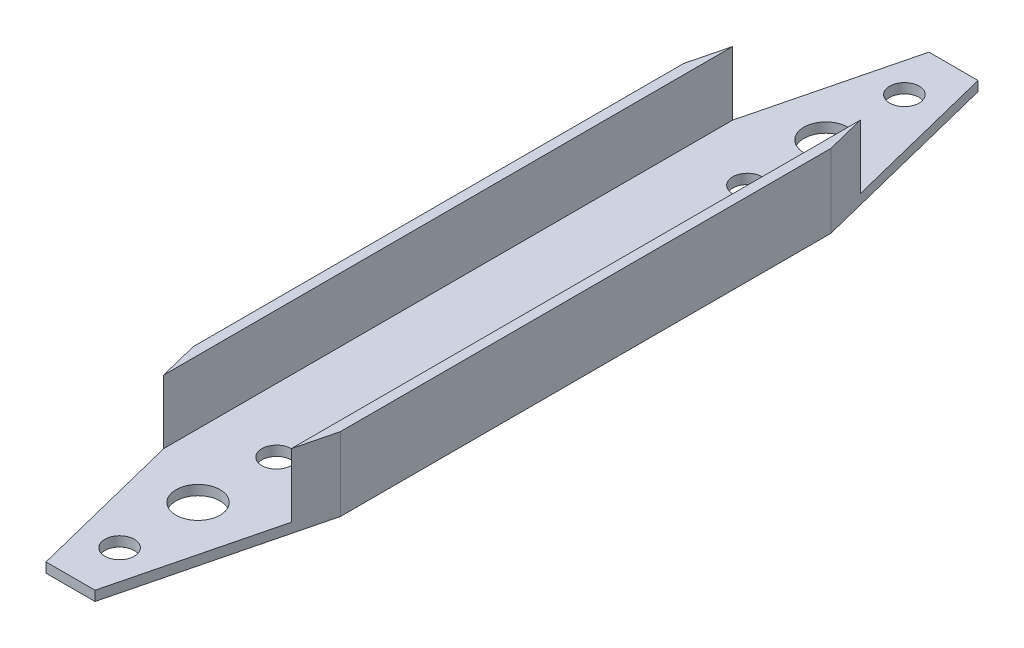
ISO-10303-21;
HEADER;
FILE_DESCRIPTION(('STEP AP214'),'2;1');
FILE_NAME('part.step','',(''),(''),'','','');
FILE_SCHEMA(('AUTOMOTIVE_DESIGN { 1 0 10303 214 1 1 1 1 }'));
ENDSEC;
DATA;
#1=APPLICATION_CONTEXT('core data for automotive mechanical design processes');
#2=APPLICATION_PROTOCOL_DEFINITION('international standard','automotive_design',2000,#1);
#3=PRODUCT_CONTEXT('',#1,'mechanical');
#4=PRODUCT('Part','Part','',(#3));
#5=PRODUCT_RELATED_PRODUCT_CATEGORY('part','',(#4));
#6=PRODUCT_DEFINITION_FORMATION('','',#4);
#7=PRODUCT_DEFINITION_CONTEXT('part definition',#1,'design');
#8=PRODUCT_DEFINITION('design','',#6,#7);
#9=PRODUCT_DEFINITION_SHAPE('','',#8);
#10=(LENGTH_UNIT() NAMED_UNIT(*) SI_UNIT(.MILLI.,.METRE.));
#11=(NAMED_UNIT(*) PLANE_ANGLE_UNIT() SI_UNIT($,.RADIAN.));
#12=(NAMED_UNIT(*) SI_UNIT($,.STERADIAN.) SOLID_ANGLE_UNIT());
#13=UNCERTAINTY_MEASURE_WITH_UNIT(LENGTH_MEASURE(1.E-05),#10,'distance_accuracy_value','');
#14=(GEOMETRIC_REPRESENTATION_CONTEXT(3) GLOBAL_UNCERTAINTY_ASSIGNED_CONTEXT((#13)) GLOBAL_UNIT_ASSIGNED_CONTEXT((#10,
#11,#12)) REPRESENTATION_CONTEXT('',''));
#15=CARTESIAN_POINT('',(0.,0.,0.));
#16=DIRECTION('',(0.,0.,1.));
#17=DIRECTION('',(1.,0.,0.));
#18=AXIS2_PLACEMENT_3D('',#15,#16,#17);
#19=CARTESIAN_POINT('',(0.,0.,180.));
#20=DIRECTION('',(1.,0.,0.));
#21=DIRECTION('',(0.,0.,-1.));
#22=AXIS2_PLACEMENT_3D('',#19,#20,#21);
#23=PLANE('',#22);
#24=DIRECTION('',(0.,0.,-1.));
#25=VECTOR('',#24,1.);
#26=CARTESIAN_POINT('',(0.,15.,180.));
#27=LINE('',#26,#25);
#28=CARTESIAN_POINT('',(0.,15.,140.));
#29=VERTEX_POINT('',#28);
#30=CARTESIAN_POINT('',(0.,15.,40.));
#31=VERTEX_POINT('',#30);
#32=EDGE_CURVE('E142',#29,#31,#27,.T.);
#33=ORIENTED_EDGE('',*,*,#32,.T.);
#34=DIRECTION('',(0.,-1.,0.));
#35=VECTOR('',#34,1.);
#36=CARTESIAN_POINT('',(0.,56.2310562561766,40.));
#37=LINE('',#36,#35);
#38=CARTESIAN_POINT('',(0.,0.,40.));
#39=VERTEX_POINT('',#38);
#40=EDGE_CURVE('E188',#31,#39,#37,.T.);
#41=ORIENTED_EDGE('',*,*,#40,.T.);
#42=DIRECTION('',(0.,0.,-1.));
#43=VECTOR('',#42,1.);
#44=CARTESIAN_POINT('',(0.,0.,180.));
#45=LINE('',#44,#43);
#46=CARTESIAN_POINT('',(0.,0.,140.));
#47=VERTEX_POINT('',#46);
#48=EDGE_CURVE('E171',#47,#39,#45,.T.);
#49=ORIENTED_EDGE('',*,*,#48,.F.);
#50=DIRECTION('',(0.,-1.,0.));
#51=VECTOR('',#50,1.);
#52=CARTESIAN_POINT('',(0.,56.2310562561766,140.));
#53=LINE('',#52,#51);
#54=EDGE_CURVE('E220',#29,#47,#53,.T.);
#55=ORIENTED_EDGE('',*,*,#54,.F.);
#56=EDGE_LOOP('',(#33,#41,#49,#55));
#57=FACE_BOUND('',#56,.T.);
#58=ADVANCED_FACE('F33',(#57),#23,.F.);
#59=CARTESIAN_POINT('',(0.,0.,180.));
#60=DIRECTION('',(0.,1.,0.));
#61=DIRECTION('',(0.,0.,1.));
#62=AXIS2_PLACEMENT_3D('',#59,#60,#61);
#63=PLANE('',#62);
#64=CARTESIAN_POINT('',(15.,0.,154.));
#65=DIRECTION('',(0.,1.,0.));
#66=DIRECTION('',(0.,0.,1.));
#67=AXIS2_PLACEMENT_3D('',#64,#65,#66);
#68=CIRCLE('',#67,4.5);
#69=CARTESIAN_POINT('',(15.,0.,158.5));
#70=VERTEX_POINT('',#69);
#71=EDGE_CURVE('E232',#70,#70,#68,.F.);
#72=ORIENTED_EDGE('',*,*,#71,.F.);
#73=EDGE_LOOP('',(#72));
#74=FACE_BOUND('',#73,.T.);
#75=CARTESIAN_POINT('',(15.,0.,138.));
#76=DIRECTION('',(0.,1.,0.));
#77=DIRECTION('',(0.,0.,1.));
#78=AXIS2_PLACEMENT_3D('',#75,#76,#77);
#79=CIRCLE('',#78,3.);
#80=CARTESIAN_POINT('',(15.,0.,141.));
#81=VERTEX_POINT('',#80);
#82=EDGE_CURVE('E233',#81,#81,#79,.F.);
#83=ORIENTED_EDGE('',*,*,#82,.F.);
#84=EDGE_LOOP('',(#83));
#85=FACE_BOUND('',#84,.T.);
#86=CARTESIAN_POINT('',(15.,0.,42.0000000000001));
#87=DIRECTION('',(0.,1.,0.));
#88=DIRECTION('',(0.,0.,1.));
#89=AXIS2_PLACEMENT_3D('',#86,#87,#88);
#90=CIRCLE('',#89,3.);
#91=CARTESIAN_POINT('',(15.,0.,45.0000000000001));
#92=VERTEX_POINT('',#91);
#93=EDGE_CURVE('E240',#92,#92,#90,.F.);
#94=ORIENTED_EDGE('',*,*,#93,.F.);
#95=EDGE_LOOP('',(#94));
#96=FACE_BOUND('',#95,.T.);
#97=CARTESIAN_POINT('',(15.,0.,26.0000000000001));
#98=DIRECTION('',(0.,1.,0.));
#99=DIRECTION('',(0.,0.,1.));
#100=AXIS2_PLACEMENT_3D('',#97,#98,#99);
#101=CIRCLE('',#100,4.5);
#102=CARTESIAN_POINT('',(15.,0.,30.5000000000001));
#103=VERTEX_POINT('',#102);
#104=EDGE_CURVE('E246',#103,#103,#101,.F.);
#105=ORIENTED_EDGE('',*,*,#104,.F.);
#106=EDGE_LOOP('',(#105));
#107=FACE_BOUND('',#106,.T.);
#108=CARTESIAN_POINT('',(15.,0.,10.0000000000001));
#109=DIRECTION('',(0.,1.,0.));
#110=DIRECTION('',(0.,0.,1.));
#111=AXIS2_PLACEMENT_3D('',#108,#109,#110);
#112=CIRCLE('',#111,3.);
#113=CARTESIAN_POINT('',(15.,0.,13.0000000000001));
#114=VERTEX_POINT('',#113);
#115=EDGE_CURVE('E252',#114,#114,#112,.F.);
#116=ORIENTED_EDGE('',*,*,#115,.F.);
#117=EDGE_LOOP('',(#116));
#118=FACE_BOUND('',#117,.T.);
#119=CARTESIAN_POINT('',(15.,0.,170.));
#120=DIRECTION('',(0.,1.,0.));
#121=DIRECTION('',(0.,0.,1.));
#122=AXIS2_PLACEMENT_3D('',#119,#120,#121);
#123=CIRCLE('',#122,3.);
#124=CARTESIAN_POINT('',(15.,0.,173.));
#125=VERTEX_POINT('',#124);
#126=EDGE_CURVE('E148',#125,#125,#123,.F.);
#127=ORIENTED_EDGE('',*,*,#126,.F.);
#128=EDGE_LOOP('',(#127));
#129=FACE_BOUND('',#128,.T.);
#130=DIRECTION('',(0.,0.,-1.));
#131=VECTOR('',#130,1.);
#132=CARTESIAN_POINT('',(30.,0.,180.));
#133=LINE('',#132,#131);
#134=CARTESIAN_POINT('',(30.,0.,140.));
#135=VERTEX_POINT('',#134);
#136=CARTESIAN_POINT('',(30.,0.,40.));
#137=VERTEX_POINT('',#136);
#138=EDGE_CURVE('E131',#135,#137,#133,.T.);
#139=ORIENTED_EDGE('',*,*,#138,.F.);
#140=DIRECTION('',(0.242535625036333,0.,-0.970142500145332));
#141=VECTOR('',#140,1.);
#142=CARTESIAN_POINT('',(20.,0.,180.));
#143=LINE('',#142,#141);
#144=CARTESIAN_POINT('',(20.,0.,180.));
#145=VERTEX_POINT('',#144);
#146=EDGE_CURVE('E119',#145,#135,#143,.T.);
#147=ORIENTED_EDGE('',*,*,#146,.F.);
#148=DIRECTION('',(1.,0.,0.));
#149=VECTOR('',#148,1.);
#150=CARTESIAN_POINT('',(0.,0.,180.));
#151=LINE('',#150,#149);
#152=CARTESIAN_POINT('',(10.,0.,180.));
#153=VERTEX_POINT('',#152);
#154=EDGE_CURVE('E129',#153,#145,#151,.T.);
#155=ORIENTED_EDGE('',*,*,#154,.F.);
#156=DIRECTION('',(0.242535625036333,0.,0.970142500145332));
#157=VECTOR('',#156,1.);
#158=CARTESIAN_POINT('',(10.,0.,180.));
#159=LINE('',#158,#157);
#160=EDGE_CURVE('E216',#47,#153,#159,.T.);
#161=ORIENTED_EDGE('',*,*,#160,.F.);
#162=ORIENTED_EDGE('',*,*,#48,.T.);
#163=DIRECTION('',(-0.242535625036333,0.,0.970142500145332));
#164=VECTOR('',#163,1.);
#165=CARTESIAN_POINT('',(10.,0.,0.));
#166=LINE('',#165,#164);
#167=CARTESIAN_POINT('',(10.,0.,0.));
#168=VERTEX_POINT('',#167);
#169=EDGE_CURVE('E180',#168,#39,#166,.T.);
#170=ORIENTED_EDGE('',*,*,#169,.F.);
#171=DIRECTION('',(1.,0.,0.));
#172=VECTOR('',#171,1.);
#173=CARTESIAN_POINT('',(0.,0.,0.));
#174=LINE('',#173,#172);
#175=CARTESIAN_POINT('',(20.,0.,0.));
#176=VERTEX_POINT('',#175);
#177=EDGE_CURVE('E145',#168,#176,#174,.T.);
#178=ORIENTED_EDGE('',*,*,#177,.T.);
#179=DIRECTION('',(-0.242535625036333,0.,-0.970142500145332));
#180=VECTOR('',#179,1.);
#181=CARTESIAN_POINT('',(20.,0.,0.));
#182=LINE('',#181,#180);
#183=EDGE_CURVE('E54',#137,#176,#182,.T.);
#184=ORIENTED_EDGE('',*,*,#183,.F.);
#185=EDGE_LOOP('',(#139,#147,#155,#161,#162,#170,#178,#184));
#186=FACE_BOUND('',#185,.T.);
#187=ADVANCED_FACE('F127',(#74,#85,#96,#107,#118,#129,#186),#63,.F.);
#188=CARTESIAN_POINT('',(30.,0.,180.));
#189=DIRECTION('',(-1.,0.,0.));
#190=DIRECTION('',(0.,0.,1.));
#191=AXIS2_PLACEMENT_3D('',#188,#189,#190);
#192=PLANE('',#191);
#193=DIRECTION('',(0.,0.,-1.));
#194=VECTOR('',#193,1.);
#195=CARTESIAN_POINT('',(30.,15.,180.));
#196=LINE('',#195,#194);
#197=CARTESIAN_POINT('',(30.,15.,140.));
#198=VERTEX_POINT('',#197);
#199=CARTESIAN_POINT('',(30.,15.,40.));
#200=VERTEX_POINT('',#199);
#201=EDGE_CURVE('E167',#198,#200,#196,.T.);
#202=ORIENTED_EDGE('',*,*,#201,.F.);
#203=DIRECTION('',(0.,-1.,0.));
#204=VECTOR('',#203,1.);
#205=CARTESIAN_POINT('',(30.,56.2310562561766,140.));
#206=LINE('',#205,#204);
#207=EDGE_CURVE('E132',#198,#135,#206,.T.);
#208=ORIENTED_EDGE('',*,*,#207,.T.);
#209=ORIENTED_EDGE('',*,*,#138,.T.);
#210=DIRECTION('',(0.,-1.,0.));
#211=VECTOR('',#210,1.);
#212=CARTESIAN_POINT('',(30.,56.2310562561766,40.));
#213=LINE('',#212,#211);
#214=EDGE_CURVE('E206',#200,#137,#213,.T.);
#215=ORIENTED_EDGE('',*,*,#214,.F.);
#216=EDGE_LOOP('',(#202,#208,#209,#215));
#217=FACE_BOUND('',#216,.T.);
#218=ADVANCED_FACE('F267',(#217),#192,.F.);
#219=CARTESIAN_POINT('',(28.,15.,180.));
#220=DIRECTION('',(0.,-1.,0.));
#221=DIRECTION('',(0.,0.,-1.));
#222=AXIS2_PLACEMENT_3D('',#219,#220,#221);
#223=PLANE('',#222);
#224=DIRECTION('',(0.,0.,-1.));
#225=VECTOR('',#224,1.);
#226=CARTESIAN_POINT('',(28.,15.,180.));
#227=LINE('',#226,#225);
#228=CARTESIAN_POINT('',(28.,15.,148.));
#229=VERTEX_POINT('',#228);
#230=CARTESIAN_POINT('',(28.,15.,32.));
#231=VERTEX_POINT('',#230);
#232=EDGE_CURVE('E164',#229,#231,#227,.T.);
#233=ORIENTED_EDGE('',*,*,#232,.F.);
#234=DIRECTION('',(-0.242535625036333,0.,0.970142500145332));
#235=VECTOR('',#234,1.);
#236=CARTESIAN_POINT('',(20.,15.,180.));
#237=LINE('',#236,#235);
#238=EDGE_CURVE('E200',#198,#229,#237,.T.);
#239=ORIENTED_EDGE('',*,*,#238,.F.);
#240=ORIENTED_EDGE('',*,*,#201,.T.);
#241=DIRECTION('',(0.242535625036333,0.,0.970142500145332));
#242=VECTOR('',#241,1.);
#243=CARTESIAN_POINT('',(20.,15.,0.));
#244=LINE('',#243,#242);
#245=EDGE_CURVE('E189',#231,#200,#244,.T.);
#246=ORIENTED_EDGE('',*,*,#245,.F.);
#247=EDGE_LOOP('',(#233,#239,#240,#246));
#248=FACE_BOUND('',#247,.T.);
#249=ADVANCED_FACE('F273',(#248),#223,.F.);
#250=CARTESIAN_POINT('',(28.,15.,180.));
#251=DIRECTION('',(1.,0.,0.));
#252=DIRECTION('',(0.,0.,-1.));
#253=AXIS2_PLACEMENT_3D('',#250,#251,#252);
#254=PLANE('',#253);
#255=DIRECTION('',(0.,0.,-1.));
#256=VECTOR('',#255,1.);
#257=CARTESIAN_POINT('',(28.,2.,180.));
#258=LINE('',#257,#256);
#259=CARTESIAN_POINT('',(28.,2.,148.));
#260=VERTEX_POINT('',#259);
#261=CARTESIAN_POINT('',(28.,2.,32.));
#262=VERTEX_POINT('',#261);
#263=EDGE_CURVE('E161',#260,#262,#258,.T.);
#264=ORIENTED_EDGE('',*,*,#263,.F.);
#265=DIRECTION('',(0.,1.,0.));
#266=VECTOR('',#265,1.);
#267=CARTESIAN_POINT('',(28.,15.,148.));
#268=LINE('',#267,#266);
#269=EDGE_CURVE('E213',#260,#229,#268,.T.);
#270=ORIENTED_EDGE('',*,*,#269,.T.);
#271=ORIENTED_EDGE('',*,*,#232,.T.);
#272=DIRECTION('',(0.,-1.,0.));
#273=VECTOR('',#272,1.);
#274=CARTESIAN_POINT('',(28.,15.,32.));
#275=LINE('',#274,#273);
#276=EDGE_CURVE('E199',#231,#262,#275,.T.);
#277=ORIENTED_EDGE('',*,*,#276,.T.);
#278=EDGE_LOOP('',(#264,#270,#271,#277));
#279=FACE_BOUND('',#278,.T.);
#280=ADVANCED_FACE('F282',(#279),#254,.F.);
#281=CARTESIAN_POINT('',(2.,2.,180.));
#282=DIRECTION('',(0.,-1.,0.));
#283=DIRECTION('',(0.,0.,-1.));
#284=AXIS2_PLACEMENT_3D('',#281,#282,#283);
#285=PLANE('',#284);
#286=CARTESIAN_POINT('',(15.,2.,154.));
#287=DIRECTION('',(0.,1.,0.));
#288=DIRECTION('',(0.,0.,1.));
#289=AXIS2_PLACEMENT_3D('',#286,#287,#288);
#290=CIRCLE('',#289,4.5);
#291=CARTESIAN_POINT('',(15.,2.,158.5));
#292=VERTEX_POINT('',#291);
#293=EDGE_CURVE('E229',#292,#292,#290,.T.);
#294=ORIENTED_EDGE('',*,*,#293,.F.);
#295=EDGE_LOOP('',(#294));
#296=FACE_BOUND('',#295,.T.);
#297=CARTESIAN_POINT('',(15.,2.,138.));
#298=DIRECTION('',(0.,1.,0.));
#299=DIRECTION('',(0.,0.,-1.));
#300=AXIS2_PLACEMENT_3D('',#297,#298,#299);
#301=CIRCLE('',#300,3.);
#302=CARTESIAN_POINT('',(15.,2.,135.));
#303=VERTEX_POINT('',#302);
#304=EDGE_CURVE('E237',#303,#303,#301,.T.);
#305=ORIENTED_EDGE('',*,*,#304,.F.);
#306=EDGE_LOOP('',(#305));
#307=FACE_BOUND('',#306,.T.);
#308=CARTESIAN_POINT('',(15.,2.,42.0000000000001));
#309=DIRECTION('',(0.,1.,0.));
#310=DIRECTION('',(0.,0.,1.));
#311=AXIS2_PLACEMENT_3D('',#308,#309,#310);
#312=CIRCLE('',#311,3.);
#313=CARTESIAN_POINT('',(15.,2.,45.0000000000001));
#314=VERTEX_POINT('',#313);
#315=EDGE_CURVE('E243',#314,#314,#312,.T.);
#316=ORIENTED_EDGE('',*,*,#315,.F.);
#317=EDGE_LOOP('',(#316));
#318=FACE_BOUND('',#317,.T.);
#319=CARTESIAN_POINT('',(15.,2.,26.0000000000001));
#320=DIRECTION('',(0.,1.,0.));
#321=DIRECTION('',(0.,0.,-1.));
#322=AXIS2_PLACEMENT_3D('',#319,#320,#321);
#323=CIRCLE('',#322,4.5);
#324=CARTESIAN_POINT('',(15.,2.,21.5000000000001));
#325=VERTEX_POINT('',#324);
#326=EDGE_CURVE('E249',#325,#325,#323,.T.);
#327=ORIENTED_EDGE('',*,*,#326,.F.);
#328=EDGE_LOOP('',(#327));
#329=FACE_BOUND('',#328,.T.);
#330=CARTESIAN_POINT('',(15.,2.,10.0000000000001));
#331=DIRECTION('',(0.,1.,0.));
#332=DIRECTION('',(0.,0.,-1.));
#333=AXIS2_PLACEMENT_3D('',#330,#331,#332);
#334=CIRCLE('',#333,3.);
#335=CARTESIAN_POINT('',(15.,2.,7.00000000000006));
#336=VERTEX_POINT('',#335);
#337=EDGE_CURVE('E228',#336,#336,#334,.T.);
#338=ORIENTED_EDGE('',*,*,#337,.F.);
#339=EDGE_LOOP('',(#338));
#340=FACE_BOUND('',#339,.T.);
#341=CARTESIAN_POINT('',(15.,2.,170.));
#342=DIRECTION('',(0.,1.,0.));
#343=DIRECTION('',(0.,0.,1.));
#344=AXIS2_PLACEMENT_3D('',#341,#342,#343);
#345=CIRCLE('',#344,3.);
#346=CARTESIAN_POINT('',(15.,2.,173.));
#347=VERTEX_POINT('',#346);
#348=EDGE_CURVE('E236',#347,#347,#345,.T.);
#349=ORIENTED_EDGE('',*,*,#348,.F.);
#350=EDGE_LOOP('',(#349));
#351=FACE_BOUND('',#350,.T.);
#352=DIRECTION('',(-1.,0.,0.));
#353=VECTOR('',#352,1.);
#354=CARTESIAN_POINT('',(2.,2.,180.));
#355=LINE('',#354,#353);
#356=CARTESIAN_POINT('',(20.,2.,180.));
#357=VERTEX_POINT('',#356);
#358=CARTESIAN_POINT('',(10.,2.,180.));
#359=VERTEX_POINT('',#358);
#360=EDGE_CURVE('E139',#357,#359,#355,.T.);
#361=ORIENTED_EDGE('',*,*,#360,.F.);
#362=DIRECTION('',(0.242535625036333,0.,-0.970142500145332));
#363=VECTOR('',#362,1.);
#364=CARTESIAN_POINT('',(18.9411764705882,2.,184.235294117647));
#365=LINE('',#364,#363);
#366=EDGE_CURVE('E47',#357,#260,#365,.T.);
#367=ORIENTED_EDGE('',*,*,#366,.T.);
#368=ORIENTED_EDGE('',*,*,#263,.T.);
#369=DIRECTION('',(-0.242535625036333,0.,-0.970142500145332));
#370=VECTOR('',#369,1.);
#371=CARTESIAN_POINT('',(61.2941176470589,2.,165.176470588235));
#372=LINE('',#371,#370);
#373=CARTESIAN_POINT('',(20.,2.,0.));
#374=VERTEX_POINT('',#373);
#375=EDGE_CURVE('E194',#262,#374,#372,.T.);
#376=ORIENTED_EDGE('',*,*,#375,.T.);
#377=DIRECTION('',(-1.,0.,0.));
#378=VECTOR('',#377,1.);
#379=CARTESIAN_POINT('',(2.,2.,0.));
#380=LINE('',#379,#378);
#381=CARTESIAN_POINT('',(10.,2.,0.));
#382=VERTEX_POINT('',#381);
#383=EDGE_CURVE('E140',#374,#382,#380,.T.);
#384=ORIENTED_EDGE('',*,*,#383,.T.);
#385=DIRECTION('',(-0.242535625036333,0.,0.970142500145332));
#386=VECTOR('',#385,1.);
#387=CARTESIAN_POINT('',(-32.8235294117646,2.,171.294117647059));
#388=LINE('',#387,#386);
#389=CARTESIAN_POINT('',(2.,2.,32.0000000000001));
#390=VERTEX_POINT('',#389);
#391=EDGE_CURVE('E183',#382,#390,#388,.T.);
#392=ORIENTED_EDGE('',*,*,#391,.T.);
#393=DIRECTION('',(0.,0.,-1.));
#394=VECTOR('',#393,1.);
#395=CARTESIAN_POINT('',(2.,2.,180.));
#396=LINE('',#395,#394);
#397=CARTESIAN_POINT('',(2.,2.,148.));
#398=VERTEX_POINT('',#397);
#399=EDGE_CURVE('E158',#398,#390,#396,.T.);
#400=ORIENTED_EDGE('',*,*,#399,.F.);
#401=DIRECTION('',(0.242535625036333,0.,0.970142500145332));
#402=VECTOR('',#401,1.);
#403=CARTESIAN_POINT('',(9.52941176470588,2.,178.117647058824));
#404=LINE('',#403,#402);
#405=EDGE_CURVE('E225',#398,#359,#404,.T.);
#406=ORIENTED_EDGE('',*,*,#405,.T.);
#407=EDGE_LOOP('',(#361,#367,#368,#376,#384,#392,#400,#406));
#408=FACE_BOUND('',#407,.T.);
#409=ADVANCED_FACE('F197',(#296,#307,#318,#329,#340,#351,#408),#285,.F.);
#410=CARTESIAN_POINT('',(2.,15.,180.));
#411=DIRECTION('',(-1.,0.,0.));
#412=DIRECTION('',(0.,-1.,0.));
#413=AXIS2_PLACEMENT_3D('',#410,#411,#412);
#414=PLANE('',#413);
#415=ORIENTED_EDGE('',*,*,#399,.T.);
#416=DIRECTION('',(0.,1.,0.));
#417=VECTOR('',#416,1.);
#418=CARTESIAN_POINT('',(2.,15.0000000000001,32.0000000000001));
#419=LINE('',#418,#417);
#420=CARTESIAN_POINT('',(2.,15.,32.0000000000001));
#421=VERTEX_POINT('',#420);
#422=EDGE_CURVE('E202',#390,#421,#419,.T.);
#423=ORIENTED_EDGE('',*,*,#422,.T.);
#424=DIRECTION('',(0.,0.,-1.));
#425=VECTOR('',#424,1.);
#426=CARTESIAN_POINT('',(2.,15.,180.));
#427=LINE('',#426,#425);
#428=CARTESIAN_POINT('',(2.,15.,148.));
#429=VERTEX_POINT('',#428);
#430=EDGE_CURVE('E155',#429,#421,#427,.T.);
#431=ORIENTED_EDGE('',*,*,#430,.F.);
#432=DIRECTION('',(0.,-1.,0.));
#433=VECTOR('',#432,1.);
#434=CARTESIAN_POINT('',(2.,15.,148.));
#435=LINE('',#434,#433);
#436=EDGE_CURVE('E219',#429,#398,#435,.T.);
#437=ORIENTED_EDGE('',*,*,#436,.T.);
#438=EDGE_LOOP('',(#415,#423,#431,#437));
#439=FACE_BOUND('',#438,.T.);
#440=ADVANCED_FACE('F289',(#439),#414,.F.);
#441=CARTESIAN_POINT('',(0.,15.,180.));
#442=DIRECTION('',(0.,-1.,0.));
#443=DIRECTION('',(0.,0.,-1.));
#444=AXIS2_PLACEMENT_3D('',#441,#442,#443);
#445=PLANE('',#444);
#446=ORIENTED_EDGE('',*,*,#430,.T.);
#447=DIRECTION('',(0.242535625036333,0.,-0.970142500145332));
#448=VECTOR('',#447,1.);
#449=CARTESIAN_POINT('',(10.,15.,0.));
#450=LINE('',#449,#448);
#451=EDGE_CURVE('E133',#31,#421,#450,.T.);
#452=ORIENTED_EDGE('',*,*,#451,.F.);
#453=ORIENTED_EDGE('',*,*,#32,.F.);
#454=DIRECTION('',(-0.242535625036333,0.,-0.970142500145332));
#455=VECTOR('',#454,1.);
#456=CARTESIAN_POINT('',(10.,15.,180.));
#457=LINE('',#456,#455);
#458=EDGE_CURVE('E217',#429,#29,#457,.T.);
#459=ORIENTED_EDGE('',*,*,#458,.F.);
#460=EDGE_LOOP('',(#446,#452,#453,#459));
#461=FACE_BOUND('',#460,.T.);
#462=ADVANCED_FACE('F293',(#461),#445,.F.);
#463=CARTESIAN_POINT('',(0.,0.,180.));
#464=DIRECTION('',(0.,0.,-1.));
#465=DIRECTION('',(-1.,0.,0.));
#466=AXIS2_PLACEMENT_3D('',#463,#464,#465);
#467=PLANE('',#466);
#468=ORIENTED_EDGE('',*,*,#154,.T.);
#469=DIRECTION('',(0.,1.,0.));
#470=VECTOR('',#469,1.);
#471=CARTESIAN_POINT('',(20.,0.,180.));
#472=LINE('',#471,#470);
#473=EDGE_CURVE('E11',#145,#357,#472,.T.);
#474=ORIENTED_EDGE('',*,*,#473,.T.);
#475=ORIENTED_EDGE('',*,*,#360,.T.);
#476=DIRECTION('',(0.,-1.,0.));
#477=VECTOR('',#476,1.);
#478=CARTESIAN_POINT('',(10.,0.,180.));
#479=LINE('',#478,#477);
#480=EDGE_CURVE('E138',#359,#153,#479,.T.);
#481=ORIENTED_EDGE('',*,*,#480,.T.);
#482=EDGE_LOOP('',(#468,#474,#475,#481));
#483=FACE_BOUND('',#482,.T.);
#484=ADVANCED_FACE('F136',(#483),#467,.F.);
#485=CARTESIAN_POINT('',(0.,0.,0.));
#486=DIRECTION('',(0.,0.,-1.));
#487=DIRECTION('',(-1.,0.,0.));
#488=AXIS2_PLACEMENT_3D('',#485,#486,#487);
#489=PLANE('',#488);
#490=DIRECTION('',(0.,-1.,0.));
#491=VECTOR('',#490,1.);
#492=CARTESIAN_POINT('',(10.,0.,0.));
#493=LINE('',#492,#491);
#494=EDGE_CURVE('E40',#382,#168,#493,.T.);
#495=ORIENTED_EDGE('',*,*,#494,.F.);
#496=ORIENTED_EDGE('',*,*,#383,.F.);
#497=DIRECTION('',(0.,1.,0.));
#498=VECTOR('',#497,1.);
#499=CARTESIAN_POINT('',(20.,0.,0.));
#500=LINE('',#499,#498);
#501=EDGE_CURVE('E175',#176,#374,#500,.T.);
#502=ORIENTED_EDGE('',*,*,#501,.F.);
#503=ORIENTED_EDGE('',*,*,#177,.F.);
#504=EDGE_LOOP('',(#495,#496,#502,#503));
#505=FACE_BOUND('',#504,.T.);
#506=ADVANCED_FACE('F191',(#505),#489,.T.);
#507=CARTESIAN_POINT('',(15.,-0.00100000000000013,170.));
#508=DIRECTION('',(0.,1.,0.));
#509=DIRECTION('',(0.,0.,1.));
#510=AXIS2_PLACEMENT_3D('',#507,#508,#509);
#511=CYLINDRICAL_SURFACE('',#510,3.);
#512=ORIENTED_EDGE('',*,*,#348,.T.);
#513=EDGE_LOOP('',(#512));
#514=FACE_BOUND('',#513,.T.);
#515=ORIENTED_EDGE('',*,*,#126,.T.);
#516=EDGE_LOOP('',(#515));
#517=FACE_BOUND('',#516,.T.);
#518=ADVANCED_FACE('F264',(#514,#517),#511,.F.);
#519=CARTESIAN_POINT('',(15.,-0.00100000000000013,10.0000000000001));
#520=DIRECTION('',(0.,1.,0.));
#521=DIRECTION('',(0.,0.,1.));
#522=AXIS2_PLACEMENT_3D('',#519,#520,#521);
#523=CYLINDRICAL_SURFACE('',#522,3.);
#524=ORIENTED_EDGE('',*,*,#337,.T.);
#525=EDGE_LOOP('',(#524));
#526=FACE_BOUND('',#525,.T.);
#527=ORIENTED_EDGE('',*,*,#115,.T.);
#528=EDGE_LOOP('',(#527));
#529=FACE_BOUND('',#528,.T.);
#530=ADVANCED_FACE('F304',(#526,#529),#523,.F.);
#531=CARTESIAN_POINT('',(15.,-0.00100000000000013,26.0000000000001));
#532=DIRECTION('',(0.,1.,0.));
#533=DIRECTION('',(0.,0.,1.));
#534=AXIS2_PLACEMENT_3D('',#531,#532,#533);
#535=CYLINDRICAL_SURFACE('',#534,4.5);
#536=ORIENTED_EDGE('',*,*,#326,.T.);
#537=EDGE_LOOP('',(#536));
#538=FACE_BOUND('',#537,.T.);
#539=ORIENTED_EDGE('',*,*,#104,.T.);
#540=EDGE_LOOP('',(#539));
#541=FACE_BOUND('',#540,.T.);
#542=ADVANCED_FACE('F307',(#538,#541),#535,.F.);
#543=CARTESIAN_POINT('',(15.,-0.00100000000000013,42.0000000000001));
#544=DIRECTION('',(0.,1.,0.));
#545=DIRECTION('',(0.,0.,1.));
#546=AXIS2_PLACEMENT_3D('',#543,#544,#545);
#547=CYLINDRICAL_SURFACE('',#546,3.);
#548=ORIENTED_EDGE('',*,*,#315,.T.);
#549=EDGE_LOOP('',(#548));
#550=FACE_BOUND('',#549,.T.);
#551=ORIENTED_EDGE('',*,*,#93,.T.);
#552=EDGE_LOOP('',(#551));
#553=FACE_BOUND('',#552,.T.);
#554=ADVANCED_FACE('F311',(#550,#553),#547,.F.);
#555=CARTESIAN_POINT('',(15.,-0.00100000000000013,138.));
#556=DIRECTION('',(0.,1.,0.));
#557=DIRECTION('',(0.,0.,1.));
#558=AXIS2_PLACEMENT_3D('',#555,#556,#557);
#559=CYLINDRICAL_SURFACE('',#558,3.);
#560=ORIENTED_EDGE('',*,*,#304,.T.);
#561=EDGE_LOOP('',(#560));
#562=FACE_BOUND('',#561,.T.);
#563=ORIENTED_EDGE('',*,*,#82,.T.);
#564=EDGE_LOOP('',(#563));
#565=FACE_BOUND('',#564,.T.);
#566=ADVANCED_FACE('F315',(#562,#565),#559,.F.);
#567=CARTESIAN_POINT('',(15.,-0.00100000000000013,154.));
#568=DIRECTION('',(0.,1.,0.));
#569=DIRECTION('',(0.,0.,1.));
#570=AXIS2_PLACEMENT_3D('',#567,#568,#569);
#571=CYLINDRICAL_SURFACE('',#570,4.5);
#572=ORIENTED_EDGE('',*,*,#293,.T.);
#573=EDGE_LOOP('',(#572));
#574=FACE_BOUND('',#573,.T.);
#575=ORIENTED_EDGE('',*,*,#71,.T.);
#576=EDGE_LOOP('',(#575));
#577=FACE_BOUND('',#576,.T.);
#578=ADVANCED_FACE('F319',(#574,#577),#571,.F.);
#579=CARTESIAN_POINT('',(10.,56.2310562561766,180.));
#580=DIRECTION('',(0.970142500145332,0.,-0.242535625036333));
#581=DIRECTION('',(-0.242535625036333,0.,-0.970142500145332));
#582=AXIS2_PLACEMENT_3D('',#579,#580,#581);
#583=PLANE('',#582);
#584=ORIENTED_EDGE('',*,*,#436,.F.);
#585=ORIENTED_EDGE('',*,*,#458,.T.);
#586=ORIENTED_EDGE('',*,*,#54,.T.);
#587=ORIENTED_EDGE('',*,*,#160,.T.);
#588=ORIENTED_EDGE('',*,*,#480,.F.);
#589=ORIENTED_EDGE('',*,*,#405,.F.);
#590=EDGE_LOOP('',(#584,#585,#586,#587,#588,#589));
#591=FACE_BOUND('',#590,.T.);
#592=ADVANCED_FACE('F323',(#591),#583,.F.);
#593=CARTESIAN_POINT('',(20.,56.2310562561766,0.));
#594=DIRECTION('',(-0.970142500145332,0.,0.242535625036333));
#595=DIRECTION('',(0.242535625036333,0.,0.970142500145332));
#596=AXIS2_PLACEMENT_3D('',#593,#594,#595);
#597=PLANE('',#596);
#598=ORIENTED_EDGE('',*,*,#245,.T.);
#599=ORIENTED_EDGE('',*,*,#214,.T.);
#600=ORIENTED_EDGE('',*,*,#183,.T.);
#601=ORIENTED_EDGE('',*,*,#501,.T.);
#602=ORIENTED_EDGE('',*,*,#375,.F.);
#603=ORIENTED_EDGE('',*,*,#276,.F.);
#604=EDGE_LOOP('',(#598,#599,#600,#601,#602,#603));
#605=FACE_BOUND('',#604,.T.);
#606=ADVANCED_FACE('F193',(#605),#597,.F.);
#607=CARTESIAN_POINT('',(10.,56.2310562561766,0.));
#608=DIRECTION('',(0.970142500145332,0.,0.242535625036333));
#609=DIRECTION('',(0.242535625036333,0.,-0.970142500145332));
#610=AXIS2_PLACEMENT_3D('',#607,#608,#609);
#611=PLANE('',#610);
#612=ORIENTED_EDGE('',*,*,#494,.T.);
#613=ORIENTED_EDGE('',*,*,#169,.T.);
#614=ORIENTED_EDGE('',*,*,#40,.F.);
#615=ORIENTED_EDGE('',*,*,#451,.T.);
#616=ORIENTED_EDGE('',*,*,#422,.F.);
#617=ORIENTED_EDGE('',*,*,#391,.F.);
#618=EDGE_LOOP('',(#612,#613,#614,#615,#616,#617));
#619=FACE_BOUND('',#618,.T.);
#620=ADVANCED_FACE('F179',(#619),#611,.F.);
#621=CARTESIAN_POINT('',(20.,56.2310562561766,180.));
#622=DIRECTION('',(-0.970142500145332,0.,-0.242535625036333));
#623=DIRECTION('',(-0.242535625036333,0.,0.970142500145332));
#624=AXIS2_PLACEMENT_3D('',#621,#622,#623);
#625=PLANE('',#624);
#626=ORIENTED_EDGE('',*,*,#366,.F.);
#627=ORIENTED_EDGE('',*,*,#473,.F.);
#628=ORIENTED_EDGE('',*,*,#146,.T.);
#629=ORIENTED_EDGE('',*,*,#207,.F.);
#630=ORIENTED_EDGE('',*,*,#238,.T.);
#631=ORIENTED_EDGE('',*,*,#269,.F.);
#632=EDGE_LOOP('',(#626,#627,#628,#629,#630,#631));
#633=FACE_BOUND('',#632,.T.);
#634=ADVANCED_FACE('F118',(#633),#625,.F.);
#635=CLOSED_SHELL('',(#58,#187,#218,#249,#280,#409,#440,#462,#484,#506,#518,#530,#542,#554,#566,
#578,#592,#606,#620,#634));
#636=MANIFOLD_SOLID_BREP('B2',#635);
#637=ADVANCED_BREP_SHAPE_REPRESENTATION('',(#18,#636),#14);
#638=SHAPE_DEFINITION_REPRESENTATION(#9,#637);
ENDSEC;
END-ISO-10303-21;
